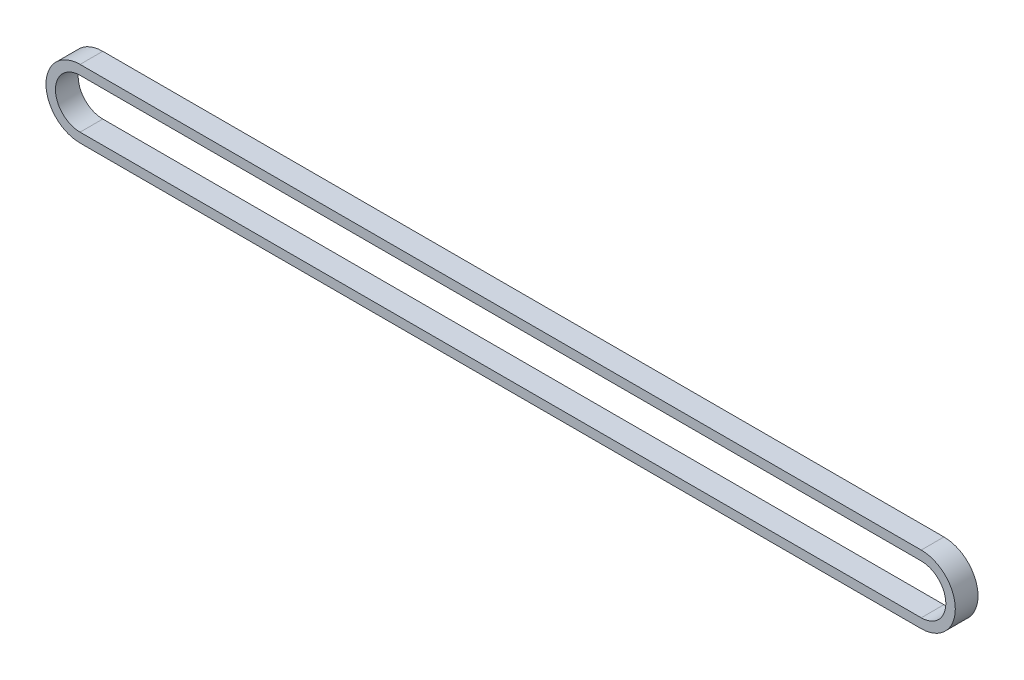
ISO-10303-21;
HEADER;
FILE_DESCRIPTION(('STEP AP214'),'2;1');
FILE_NAME('part.step','',(''),(''),'','','');
FILE_SCHEMA(('AUTOMOTIVE_DESIGN { 1 0 10303 214 1 1 1 1 }'));
ENDSEC;
DATA;
#1=APPLICATION_CONTEXT('core data for automotive mechanical design processes');
#2=APPLICATION_PROTOCOL_DEFINITION('international standard','automotive_design',2000,#1);
#3=PRODUCT_CONTEXT('',#1,'mechanical');
#4=PRODUCT('Part','Part','',(#3));
#5=PRODUCT_RELATED_PRODUCT_CATEGORY('part','',(#4));
#6=PRODUCT_DEFINITION_FORMATION('','',#4);
#7=PRODUCT_DEFINITION_CONTEXT('part definition',#1,'design');
#8=PRODUCT_DEFINITION('design','',#6,#7);
#9=PRODUCT_DEFINITION_SHAPE('','',#8);
#10=(LENGTH_UNIT() NAMED_UNIT(*) SI_UNIT(.MILLI.,.METRE.));
#11=(NAMED_UNIT(*) PLANE_ANGLE_UNIT() SI_UNIT($,.RADIAN.));
#12=(NAMED_UNIT(*) SI_UNIT($,.STERADIAN.) SOLID_ANGLE_UNIT());
#13=UNCERTAINTY_MEASURE_WITH_UNIT(LENGTH_MEASURE(1.E-05),#10,'distance_accuracy_value','');
#14=(GEOMETRIC_REPRESENTATION_CONTEXT(3) GLOBAL_UNCERTAINTY_ASSIGNED_CONTEXT((#13)) GLOBAL_UNIT_ASSIGNED_CONTEXT((#10,
#11,#12)) REPRESENTATION_CONTEXT('',''));
#15=CARTESIAN_POINT('',(0.,0.,0.));
#16=DIRECTION('',(0.,0.,1.));
#17=DIRECTION('',(1.,0.,0.));
#18=AXIS2_PLACEMENT_3D('',#15,#16,#17);
#19=CARTESIAN_POINT('',(-111.125,0.,6.));
#20=DIRECTION('',(0.,0.,1.));
#21=DIRECTION('',(1.,0.,0.));
#22=AXIS2_PLACEMENT_3D('',#19,#20,#21);
#23=PLANE('',#22);
#24=CARTESIAN_POINT('',(-111.125,0.,6.));
#25=DIRECTION('',(0.,0.,1.));
#26=DIRECTION('',(1.,0.,0.));
#27=AXIS2_PLACEMENT_3D('',#24,#25,#26);
#28=CIRCLE('',#27,9.);
#29=CARTESIAN_POINT('',(-111.125,9.,6.));
#30=VERTEX_POINT('',#29);
#31=CARTESIAN_POINT('',(-111.125,-9.,6.));
#32=VERTEX_POINT('',#31);
#33=EDGE_CURVE('E157',#30,#32,#28,.T.);
#34=ORIENTED_EDGE('',*,*,#33,.T.);
#35=DIRECTION('',(1.,0.,0.));
#36=VECTOR('',#35,1.);
#37=CARTESIAN_POINT('',(-111.125,-9.,6.));
#38=LINE('',#37,#36);
#39=CARTESIAN_POINT('',(111.125,-8.99999999999993,6.));
#40=VERTEX_POINT('',#39);
#41=EDGE_CURVE('E161',#32,#40,#38,.T.);
#42=ORIENTED_EDGE('',*,*,#41,.T.);
#43=CARTESIAN_POINT('',(111.125,0.,6.));
#44=DIRECTION('',(0.,0.,1.));
#45=DIRECTION('',(1.,0.,0.));
#46=AXIS2_PLACEMENT_3D('',#43,#44,#45);
#47=CIRCLE('',#46,8.99999999999998);
#48=CARTESIAN_POINT('',(111.125,9.,6.));
#49=VERTEX_POINT('',#48);
#50=EDGE_CURVE('E165',#40,#49,#47,.T.);
#51=ORIENTED_EDGE('',*,*,#50,.T.);
#52=DIRECTION('',(-1.,0.,0.));
#53=VECTOR('',#52,1.);
#54=CARTESIAN_POINT('',(-111.125,9.,6.));
#55=LINE('',#54,#53);
#56=EDGE_CURVE('E168',#49,#30,#55,.T.);
#57=ORIENTED_EDGE('',*,*,#56,.T.);
#58=EDGE_LOOP('',(#34,#42,#51,#57));
#59=FACE_BOUND('',#58,.T.);
#60=DIRECTION('',(1.,0.,0.));
#61=VECTOR('',#60,1.);
#62=CARTESIAN_POINT('',(-111.125,-6.5,6.));
#63=LINE('',#62,#61);
#64=CARTESIAN_POINT('',(-111.125,-6.5,6.));
#65=VERTEX_POINT('',#64);
#66=CARTESIAN_POINT('',(111.125,-6.49999999999996,6.));
#67=VERTEX_POINT('',#66);
#68=EDGE_CURVE('E118',#65,#67,#63,.T.);
#69=ORIENTED_EDGE('',*,*,#68,.F.);
#70=CARTESIAN_POINT('',(-111.125,0.,6.));
#71=DIRECTION('',(0.,0.,1.));
#72=DIRECTION('',(1.,0.,0.));
#73=AXIS2_PLACEMENT_3D('',#70,#71,#72);
#74=CIRCLE('',#73,6.5);
#75=CARTESIAN_POINT('',(-111.125,6.5,6.));
#76=VERTEX_POINT('',#75);
#77=EDGE_CURVE('E109',#76,#65,#74,.T.);
#78=ORIENTED_EDGE('',*,*,#77,.F.);
#79=DIRECTION('',(-1.,0.,0.));
#80=VECTOR('',#79,1.);
#81=CARTESIAN_POINT('',(-111.125,6.5,6.));
#82=LINE('',#81,#80);
#83=CARTESIAN_POINT('',(111.125,6.50000000000004,6.));
#84=VERTEX_POINT('',#83);
#85=EDGE_CURVE('E135',#84,#76,#82,.T.);
#86=ORIENTED_EDGE('',*,*,#85,.F.);
#87=CARTESIAN_POINT('',(111.125,0.,6.));
#88=DIRECTION('',(0.,0.,1.));
#89=DIRECTION('',(1.,0.,0.));
#90=AXIS2_PLACEMENT_3D('',#87,#88,#89);
#91=CIRCLE('',#90,6.5);
#92=EDGE_CURVE('E131',#67,#84,#91,.T.);
#93=ORIENTED_EDGE('',*,*,#92,.F.);
#94=EDGE_LOOP('',(#69,#78,#86,#93));
#95=FACE_BOUND('',#94,.T.);
#96=ADVANCED_FACE('F43',(#59,#95),#23,.T.);
#97=CARTESIAN_POINT('',(-111.125,0.,0.));
#98=DIRECTION('',(0.,0.,1.));
#99=DIRECTION('',(1.,0.,0.));
#100=AXIS2_PLACEMENT_3D('',#97,#98,#99);
#101=PLANE('',#100);
#102=CARTESIAN_POINT('',(-111.125,0.,0.));
#103=DIRECTION('',(0.,0.,1.));
#104=DIRECTION('',(1.,0.,0.));
#105=AXIS2_PLACEMENT_3D('',#102,#103,#104);
#106=CIRCLE('',#105,9.);
#107=CARTESIAN_POINT('',(-111.125,9.,0.));
#108=VERTEX_POINT('',#107);
#109=CARTESIAN_POINT('',(-111.125,-9.,0.));
#110=VERTEX_POINT('',#109);
#111=EDGE_CURVE('E127',#108,#110,#106,.T.);
#112=ORIENTED_EDGE('',*,*,#111,.F.);
#113=DIRECTION('',(-1.,0.,0.));
#114=VECTOR('',#113,1.);
#115=CARTESIAN_POINT('',(-111.125,9.,0.));
#116=LINE('',#115,#114);
#117=CARTESIAN_POINT('',(111.125,9.,0.));
#118=VERTEX_POINT('',#117);
#119=EDGE_CURVE('E162',#118,#108,#116,.T.);
#120=ORIENTED_EDGE('',*,*,#119,.F.);
#121=CARTESIAN_POINT('',(111.125,0.,0.));
#122=DIRECTION('',(0.,0.,1.));
#123=DIRECTION('',(1.,0.,0.));
#124=AXIS2_PLACEMENT_3D('',#121,#122,#123);
#125=CIRCLE('',#124,8.99999999999998);
#126=CARTESIAN_POINT('',(111.125,-8.99999999999993,0.));
#127=VERTEX_POINT('',#126);
#128=EDGE_CURVE('E178',#127,#118,#125,.T.);
#129=ORIENTED_EDGE('',*,*,#128,.F.);
#130=DIRECTION('',(1.,0.,0.));
#131=VECTOR('',#130,1.);
#132=CARTESIAN_POINT('',(-111.125,-9.,0.));
#133=LINE('',#132,#131);
#134=EDGE_CURVE('E175',#110,#127,#133,.T.);
#135=ORIENTED_EDGE('',*,*,#134,.F.);
#136=EDGE_LOOP('',(#112,#120,#129,#135));
#137=FACE_BOUND('',#136,.T.);
#138=CARTESIAN_POINT('',(-111.125,0.,0.));
#139=DIRECTION('',(0.,0.,1.));
#140=DIRECTION('',(1.,0.,0.));
#141=AXIS2_PLACEMENT_3D('',#138,#139,#140);
#142=CIRCLE('',#141,6.5);
#143=CARTESIAN_POINT('',(-111.125,6.5,0.));
#144=VERTEX_POINT('',#143);
#145=CARTESIAN_POINT('',(-111.125,-6.5,0.));
#146=VERTEX_POINT('',#145);
#147=EDGE_CURVE('E67',#144,#146,#142,.T.);
#148=ORIENTED_EDGE('',*,*,#147,.T.);
#149=DIRECTION('',(1.,0.,0.));
#150=VECTOR('',#149,1.);
#151=CARTESIAN_POINT('',(-111.125,-6.5,0.));
#152=LINE('',#151,#150);
#153=CARTESIAN_POINT('',(111.125,-6.49999999999996,0.));
#154=VERTEX_POINT('',#153);
#155=EDGE_CURVE('E125',#146,#154,#152,.T.);
#156=ORIENTED_EDGE('',*,*,#155,.T.);
#157=CARTESIAN_POINT('',(111.125,0.,0.));
#158=DIRECTION('',(0.,0.,1.));
#159=DIRECTION('',(1.,0.,0.));
#160=AXIS2_PLACEMENT_3D('',#157,#158,#159);
#161=CIRCLE('',#160,6.5);
#162=CARTESIAN_POINT('',(111.125,6.50000000000004,0.));
#163=VERTEX_POINT('',#162);
#164=EDGE_CURVE('E144',#154,#163,#161,.T.);
#165=ORIENTED_EDGE('',*,*,#164,.T.);
#166=DIRECTION('',(-1.,0.,0.));
#167=VECTOR('',#166,1.);
#168=CARTESIAN_POINT('',(-111.125,6.5,0.));
#169=LINE('',#168,#167);
#170=EDGE_CURVE('E119',#163,#144,#169,.T.);
#171=ORIENTED_EDGE('',*,*,#170,.T.);
#172=EDGE_LOOP('',(#148,#156,#165,#171));
#173=FACE_BOUND('',#172,.T.);
#174=ADVANCED_FACE('F201',(#137,#173),#101,.F.);
#175=CARTESIAN_POINT('',(-111.125,0.,6.));
#176=DIRECTION('',(0.,0.,-1.));
#177=DIRECTION('',(-1.,0.,0.));
#178=AXIS2_PLACEMENT_3D('',#175,#176,#177);
#179=CYLINDRICAL_SURFACE('',#178,9.);
#180=ORIENTED_EDGE('',*,*,#111,.T.);
#181=DIRECTION('',(0.,0.,-1.));
#182=VECTOR('',#181,1.);
#183=CARTESIAN_POINT('',(-111.125,-9.,6.));
#184=LINE('',#183,#182);
#185=EDGE_CURVE('E11',#32,#110,#184,.T.);
#186=ORIENTED_EDGE('',*,*,#185,.F.);
#187=ORIENTED_EDGE('',*,*,#33,.F.);
#188=DIRECTION('',(0.,0.,-1.));
#189=VECTOR('',#188,1.);
#190=CARTESIAN_POINT('',(-111.125,9.,6.));
#191=LINE('',#190,#189);
#192=EDGE_CURVE('E171',#30,#108,#191,.T.);
#193=ORIENTED_EDGE('',*,*,#192,.T.);
#194=EDGE_LOOP('',(#180,#186,#187,#193));
#195=FACE_BOUND('',#194,.T.);
#196=ADVANCED_FACE('F45',(#195),#179,.T.);
#197=CARTESIAN_POINT('',(-111.125,-9.,6.));
#198=DIRECTION('',(0.,1.,0.));
#199=DIRECTION('',(-1.,0.,0.));
#200=AXIS2_PLACEMENT_3D('',#197,#198,#199);
#201=PLANE('',#200);
#202=ORIENTED_EDGE('',*,*,#134,.T.);
#203=DIRECTION('',(0.,0.,-1.));
#204=VECTOR('',#203,1.);
#205=CARTESIAN_POINT('',(111.125,-8.99999999999993,6.));
#206=LINE('',#205,#204);
#207=EDGE_CURVE('E52',#40,#127,#206,.T.);
#208=ORIENTED_EDGE('',*,*,#207,.F.);
#209=ORIENTED_EDGE('',*,*,#41,.F.);
#210=ORIENTED_EDGE('',*,*,#185,.T.);
#211=EDGE_LOOP('',(#202,#208,#209,#210));
#212=FACE_BOUND('',#211,.T.);
#213=ADVANCED_FACE('F211',(#212),#201,.F.);
#214=CARTESIAN_POINT('',(111.125,0.,6.));
#215=DIRECTION('',(0.,0.,-1.));
#216=DIRECTION('',(-1.,0.,0.));
#217=AXIS2_PLACEMENT_3D('',#214,#215,#216);
#218=CYLINDRICAL_SURFACE('',#217,8.99999999999998);
#219=ORIENTED_EDGE('',*,*,#128,.T.);
#220=DIRECTION('',(0.,0.,-1.));
#221=VECTOR('',#220,1.);
#222=CARTESIAN_POINT('',(111.125,9.,6.));
#223=LINE('',#222,#221);
#224=EDGE_CURVE('E186',#49,#118,#223,.T.);
#225=ORIENTED_EDGE('',*,*,#224,.F.);
#226=ORIENTED_EDGE('',*,*,#50,.F.);
#227=ORIENTED_EDGE('',*,*,#207,.T.);
#228=EDGE_LOOP('',(#219,#225,#226,#227));
#229=FACE_BOUND('',#228,.T.);
#230=ADVANCED_FACE('F195',(#229),#218,.T.);
#231=CARTESIAN_POINT('',(-111.125,9.,6.));
#232=DIRECTION('',(0.,-1.,0.));
#233=DIRECTION('',(0.,0.,-1.));
#234=AXIS2_PLACEMENT_3D('',#231,#232,#233);
#235=PLANE('',#234);
#236=ORIENTED_EDGE('',*,*,#119,.T.);
#237=ORIENTED_EDGE('',*,*,#192,.F.);
#238=ORIENTED_EDGE('',*,*,#56,.F.);
#239=ORIENTED_EDGE('',*,*,#224,.T.);
#240=EDGE_LOOP('',(#236,#237,#238,#239));
#241=FACE_BOUND('',#240,.T.);
#242=ADVANCED_FACE('F205',(#241),#235,.F.);
#243=CARTESIAN_POINT('',(-111.125,0.,6.));
#244=DIRECTION('',(0.,0.,-1.));
#245=DIRECTION('',(-1.,0.,0.));
#246=AXIS2_PLACEMENT_3D('',#243,#244,#245);
#247=CYLINDRICAL_SURFACE('',#246,6.5);
#248=ORIENTED_EDGE('',*,*,#147,.F.);
#249=DIRECTION('',(0.,0.,-1.));
#250=VECTOR('',#249,1.);
#251=CARTESIAN_POINT('',(-111.125,6.5,6.));
#252=LINE('',#251,#250);
#253=EDGE_CURVE('E113',#76,#144,#252,.T.);
#254=ORIENTED_EDGE('',*,*,#253,.F.);
#255=ORIENTED_EDGE('',*,*,#77,.T.);
#256=DIRECTION('',(0.,0.,-1.));
#257=VECTOR('',#256,1.);
#258=CARTESIAN_POINT('',(-111.125,-6.5,6.));
#259=LINE('',#258,#257);
#260=EDGE_CURVE('E112',#65,#146,#259,.T.);
#261=ORIENTED_EDGE('',*,*,#260,.T.);
#262=EDGE_LOOP('',(#248,#254,#255,#261));
#263=FACE_BOUND('',#262,.T.);
#264=ADVANCED_FACE('F111',(#263),#247,.F.);
#265=CARTESIAN_POINT('',(-111.125,-6.5,6.));
#266=DIRECTION('',(0.,1.,0.));
#267=DIRECTION('',(-1.,0.,0.));
#268=AXIS2_PLACEMENT_3D('',#265,#266,#267);
#269=PLANE('',#268);
#270=ORIENTED_EDGE('',*,*,#155,.F.);
#271=ORIENTED_EDGE('',*,*,#260,.F.);
#272=ORIENTED_EDGE('',*,*,#68,.T.);
#273=DIRECTION('',(0.,0.,-1.));
#274=VECTOR('',#273,1.);
#275=CARTESIAN_POINT('',(111.125,-6.49999999999996,6.));
#276=LINE('',#275,#274);
#277=EDGE_CURVE('E128',#67,#154,#276,.T.);
#278=ORIENTED_EDGE('',*,*,#277,.T.);
#279=EDGE_LOOP('',(#270,#271,#272,#278));
#280=FACE_BOUND('',#279,.T.);
#281=ADVANCED_FACE('F122',(#280),#269,.T.);
#282=CARTESIAN_POINT('',(111.125,0.,6.));
#283=DIRECTION('',(0.,0.,-1.));
#284=DIRECTION('',(-1.,0.,0.));
#285=AXIS2_PLACEMENT_3D('',#282,#283,#284);
#286=CYLINDRICAL_SURFACE('',#285,6.5);
#287=ORIENTED_EDGE('',*,*,#164,.F.);
#288=ORIENTED_EDGE('',*,*,#277,.F.);
#289=ORIENTED_EDGE('',*,*,#92,.T.);
#290=DIRECTION('',(0.,0.,-1.));
#291=VECTOR('',#290,1.);
#292=CARTESIAN_POINT('',(111.125,6.50000000000004,6.));
#293=LINE('',#292,#291);
#294=EDGE_CURVE('E59',#84,#163,#293,.T.);
#295=ORIENTED_EDGE('',*,*,#294,.T.);
#296=EDGE_LOOP('',(#287,#288,#289,#295));
#297=FACE_BOUND('',#296,.T.);
#298=ADVANCED_FACE('F234',(#297),#286,.F.);
#299=CARTESIAN_POINT('',(-111.125,6.5,6.));
#300=DIRECTION('',(0.,-1.,0.));
#301=DIRECTION('',(1.,0.,0.));
#302=AXIS2_PLACEMENT_3D('',#299,#300,#301);
#303=PLANE('',#302);
#304=ORIENTED_EDGE('',*,*,#170,.F.);
#305=ORIENTED_EDGE('',*,*,#294,.F.);
#306=ORIENTED_EDGE('',*,*,#85,.T.);
#307=ORIENTED_EDGE('',*,*,#253,.T.);
#308=EDGE_LOOP('',(#304,#305,#306,#307));
#309=FACE_BOUND('',#308,.T.);
#310=ADVANCED_FACE('F238',(#309),#303,.T.);
#311=CLOSED_SHELL('',(#96,#174,#196,#213,#230,#242,#264,#281,#298,#310));
#312=MANIFOLD_SOLID_BREP('B2',#311);
#313=ADVANCED_BREP_SHAPE_REPRESENTATION('',(#18,#312),#14);
#314=SHAPE_DEFINITION_REPRESENTATION(#9,#313);
ENDSEC;
END-ISO-10303-21;
